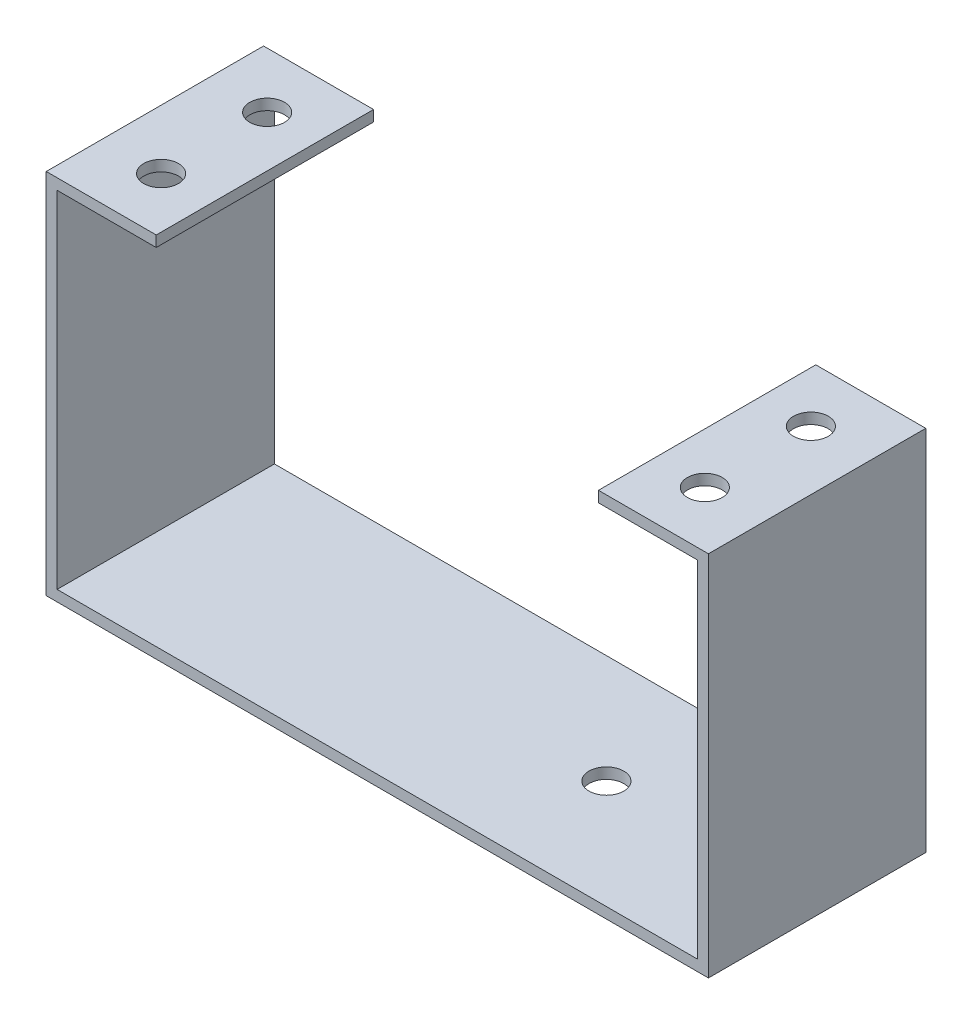
ISO-10303-21;
HEADER;
FILE_DESCRIPTION(('STEP AP214'),'2;1');
FILE_NAME('part.step','',(''),(''),'','','');
FILE_SCHEMA(('AUTOMOTIVE_DESIGN { 1 0 10303 214 1 1 1 1 }'));
ENDSEC;
DATA;
#1=APPLICATION_CONTEXT('core data for automotive mechanical design processes');
#2=APPLICATION_PROTOCOL_DEFINITION('international standard','automotive_design',2000,#1);
#3=PRODUCT_CONTEXT('',#1,'mechanical');
#4=PRODUCT('Part','Part','',(#3));
#5=PRODUCT_RELATED_PRODUCT_CATEGORY('part','',(#4));
#6=PRODUCT_DEFINITION_FORMATION('','',#4);
#7=PRODUCT_DEFINITION_CONTEXT('part definition',#1,'design');
#8=PRODUCT_DEFINITION('design','',#6,#7);
#9=PRODUCT_DEFINITION_SHAPE('','',#8);
#10=(LENGTH_UNIT() NAMED_UNIT(*) SI_UNIT(.MILLI.,.METRE.));
#11=(NAMED_UNIT(*) PLANE_ANGLE_UNIT() SI_UNIT($,.RADIAN.));
#12=(NAMED_UNIT(*) SI_UNIT($,.STERADIAN.) SOLID_ANGLE_UNIT());
#13=UNCERTAINTY_MEASURE_WITH_UNIT(LENGTH_MEASURE(1.E-05),#10,'distance_accuracy_value','');
#14=(GEOMETRIC_REPRESENTATION_CONTEXT(3) GLOBAL_UNCERTAINTY_ASSIGNED_CONTEXT((#13)) GLOBAL_UNIT_ASSIGNED_CONTEXT((#10,
#11,#12)) REPRESENTATION_CONTEXT('',''));
#15=CARTESIAN_POINT('',(0.,0.,0.));
#16=DIRECTION('',(0.,0.,1.));
#17=DIRECTION('',(1.,0.,0.));
#18=AXIS2_PLACEMENT_3D('',#15,#16,#17);
#19=CARTESIAN_POINT('',(0.999999999999998,33.81,-20.));
#20=DIRECTION('',(-1.,0.,0.));
#21=DIRECTION('',(0.,0.,1.));
#22=AXIS2_PLACEMENT_3D('',#19,#20,#21);
#23=PLANE('',#22);
#24=DIRECTION('',(0.,0.,-1.));
#25=VECTOR('',#24,1.);
#26=CARTESIAN_POINT('',(1.,32.81,0.));
#27=LINE('',#26,#25);
#28=CARTESIAN_POINT('',(1.,32.81,0.));
#29=VERTEX_POINT('',#28);
#30=CARTESIAN_POINT('',(0.999999999999998,32.81,-20.));
#31=VERTEX_POINT('',#30);
#32=EDGE_CURVE('E148',#29,#31,#27,.T.);
#33=ORIENTED_EDGE('',*,*,#32,.F.);
#34=DIRECTION('',(0.,-1.,0.));
#35=VECTOR('',#34,1.);
#36=CARTESIAN_POINT('',(1.,33.81,0.));
#37=LINE('',#36,#35);
#38=CARTESIAN_POINT('',(1.,1.,0.));
#39=VERTEX_POINT('',#38);
#40=EDGE_CURVE('E52',#29,#39,#37,.T.);
#41=ORIENTED_EDGE('',*,*,#40,.T.);
#42=DIRECTION('',(0.,0.,-1.));
#43=VECTOR('',#42,1.);
#44=CARTESIAN_POINT('',(0.999999999999998,1.,-20.));
#45=LINE('',#44,#43);
#46=CARTESIAN_POINT('',(1.,1.,-20.));
#47=VERTEX_POINT('',#46);
#48=EDGE_CURVE('E174',#39,#47,#45,.T.);
#49=ORIENTED_EDGE('',*,*,#48,.T.);
#50=DIRECTION('',(0.,-1.,0.));
#51=VECTOR('',#50,1.);
#52=CARTESIAN_POINT('',(0.999999999999998,33.81,-20.));
#53=LINE('',#52,#51);
#54=EDGE_CURVE('E60',#31,#47,#53,.T.);
#55=ORIENTED_EDGE('',*,*,#54,.F.);
#56=EDGE_LOOP('',(#33,#41,#49,#55));
#57=FACE_BOUND('',#56,.T.);
#58=ADVANCED_FACE('F34',(#57),#23,.F.);
#59=CARTESIAN_POINT('',(59.94,33.81,-20.));
#60=DIRECTION('',(1.,0.,0.));
#61=DIRECTION('',(0.,0.,-1.));
#62=AXIS2_PLACEMENT_3D('',#59,#60,#61);
#63=PLANE('',#62);
#64=DIRECTION('',(0.,0.,1.));
#65=VECTOR('',#64,1.);
#66=CARTESIAN_POINT('',(59.94,32.81,-20.));
#67=LINE('',#66,#65);
#68=CARTESIAN_POINT('',(59.94,32.81,-20.));
#69=VERTEX_POINT('',#68);
#70=CARTESIAN_POINT('',(59.94,32.81,0.));
#71=VERTEX_POINT('',#70);
#72=EDGE_CURVE('E152',#69,#71,#67,.T.);
#73=ORIENTED_EDGE('',*,*,#72,.F.);
#74=DIRECTION('',(0.,-1.,0.));
#75=VECTOR('',#74,1.);
#76=CARTESIAN_POINT('',(59.94,33.81,-20.));
#77=LINE('',#76,#75);
#78=CARTESIAN_POINT('',(59.94,1.,-20.));
#79=VERTEX_POINT('',#78);
#80=EDGE_CURVE('E38',#69,#79,#77,.T.);
#81=ORIENTED_EDGE('',*,*,#80,.T.);
#82=DIRECTION('',(0.,0.,1.));
#83=VECTOR('',#82,1.);
#84=CARTESIAN_POINT('',(59.94,1.,-20.));
#85=LINE('',#84,#83);
#86=CARTESIAN_POINT('',(59.94,1.,0.));
#87=VERTEX_POINT('',#86);
#88=EDGE_CURVE('E186',#79,#87,#85,.T.);
#89=ORIENTED_EDGE('',*,*,#88,.T.);
#90=DIRECTION('',(0.,-1.,0.));
#91=VECTOR('',#90,1.);
#92=CARTESIAN_POINT('',(59.94,33.81,0.));
#93=LINE('',#92,#91);
#94=EDGE_CURVE('E195',#71,#87,#93,.T.);
#95=ORIENTED_EDGE('',*,*,#94,.F.);
#96=EDGE_LOOP('',(#73,#81,#89,#95));
#97=FACE_BOUND('',#96,.T.);
#98=ADVANCED_FACE('F242',(#97),#63,.F.);
#99=CARTESIAN_POINT('',(0.,1.,0.));
#100=DIRECTION('',(0.,-1.,0.));
#101=DIRECTION('',(0.,0.,-1.));
#102=AXIS2_PLACEMENT_3D('',#99,#100,#101);
#103=PLANE('',#102);
#104=CARTESIAN_POINT('',(41.55,1.,-10.));
#105=DIRECTION('',(0.,-1.,0.));
#106=DIRECTION('',(0.,0.,-1.));
#107=AXIS2_PLACEMENT_3D('',#104,#105,#106);
#108=CIRCLE('',#107,1.6);
#109=CARTESIAN_POINT('',(41.55,1.,-11.6));
#110=VERTEX_POINT('',#109);
#111=EDGE_CURVE('E279',#110,#110,#108,.T.);
#112=ORIENTED_EDGE('',*,*,#111,.T.);
#113=EDGE_LOOP('',(#112));
#114=FACE_BOUND('',#113,.T.);
#115=ORIENTED_EDGE('',*,*,#48,.F.);
#116=DIRECTION('',(1.,0.,0.));
#117=VECTOR('',#116,1.);
#118=CARTESIAN_POINT('',(0.,1.,0.));
#119=LINE('',#118,#117);
#120=EDGE_CURVE('E208',#39,#87,#119,.T.);
#121=ORIENTED_EDGE('',*,*,#120,.T.);
#122=ORIENTED_EDGE('',*,*,#88,.F.);
#123=DIRECTION('',(-1.,0.,0.));
#124=VECTOR('',#123,1.);
#125=CARTESIAN_POINT('',(0.,1.,-20.));
#126=LINE('',#125,#124);
#127=EDGE_CURVE('E204',#79,#47,#126,.T.);
#128=ORIENTED_EDGE('',*,*,#127,.T.);
#129=EDGE_LOOP('',(#115,#121,#122,#128));
#130=FACE_BOUND('',#129,.T.);
#131=ADVANCED_FACE('F245',(#114,#130),#103,.F.);
#132=CARTESIAN_POINT('',(0.,1.,0.));
#133=DIRECTION('',(1.,0.,0.));
#134=DIRECTION('',(0.,0.,-1.));
#135=AXIS2_PLACEMENT_3D('',#132,#133,#134);
#136=PLANE('',#135);
#137=DIRECTION('',(0.,0.,1.));
#138=VECTOR('',#137,1.);
#139=CARTESIAN_POINT('',(0.,0.,0.));
#140=LINE('',#139,#138);
#141=CARTESIAN_POINT('',(0.,0.,-20.));
#142=VERTEX_POINT('',#141);
#143=CARTESIAN_POINT('',(0.,0.,0.));
#144=VERTEX_POINT('',#143);
#145=EDGE_CURVE('E235',#142,#144,#140,.T.);
#146=ORIENTED_EDGE('',*,*,#145,.T.);
#147=DIRECTION('',(0.,-1.,0.));
#148=VECTOR('',#147,1.);
#149=CARTESIAN_POINT('',(0.,1.,0.));
#150=LINE('',#149,#148);
#151=CARTESIAN_POINT('',(0.,33.81,0.));
#152=VERTEX_POINT('',#151);
#153=EDGE_CURVE('E11',#152,#144,#150,.T.);
#154=ORIENTED_EDGE('',*,*,#153,.F.);
#155=DIRECTION('',(0.,0.,1.));
#156=VECTOR('',#155,1.);
#157=CARTESIAN_POINT('',(0.,33.81,-20.));
#158=LINE('',#157,#156);
#159=CARTESIAN_POINT('',(0.,33.81,-20.));
#160=VERTEX_POINT('',#159);
#161=EDGE_CURVE('E175',#160,#152,#158,.T.);
#162=ORIENTED_EDGE('',*,*,#161,.F.);
#163=DIRECTION('',(0.,-1.,0.));
#164=VECTOR('',#163,1.);
#165=CARTESIAN_POINT('',(0.,1.,-20.));
#166=LINE('',#165,#164);
#167=EDGE_CURVE('E213',#160,#142,#166,.T.);
#168=ORIENTED_EDGE('',*,*,#167,.T.);
#169=EDGE_LOOP('',(#146,#154,#162,#168));
#170=FACE_BOUND('',#169,.T.);
#171=ADVANCED_FACE('F36',(#170),#136,.F.);
#172=CARTESIAN_POINT('',(0.,1.,0.));
#173=DIRECTION('',(0.,0.,-1.));
#174=DIRECTION('',(-1.,0.,0.));
#175=AXIS2_PLACEMENT_3D('',#172,#173,#174);
#176=PLANE('',#175);
#177=DIRECTION('',(1.,0.,0.));
#178=VECTOR('',#177,1.);
#179=CARTESIAN_POINT('',(0.,0.,0.));
#180=LINE('',#179,#178);
#181=CARTESIAN_POINT('',(60.94,0.,0.));
#182=VERTEX_POINT('',#181);
#183=EDGE_CURVE('E219',#144,#182,#180,.T.);
#184=ORIENTED_EDGE('',*,*,#183,.T.);
#185=DIRECTION('',(0.,-1.,0.));
#186=VECTOR('',#185,1.);
#187=CARTESIAN_POINT('',(60.94,1.,0.));
#188=LINE('',#187,#186);
#189=CARTESIAN_POINT('',(60.94,33.81,0.));
#190=VERTEX_POINT('',#189);
#191=EDGE_CURVE('E44',#190,#182,#188,.T.);
#192=ORIENTED_EDGE('',*,*,#191,.F.);
#193=DIRECTION('',(1.,0.,0.));
#194=VECTOR('',#193,1.);
#195=CARTESIAN_POINT('',(60.94,33.81,0.));
#196=LINE('',#195,#194);
#197=CARTESIAN_POINT('',(50.82,33.81,0.));
#198=VERTEX_POINT('',#197);
#199=EDGE_CURVE('E192',#198,#190,#196,.T.);
#200=ORIENTED_EDGE('',*,*,#199,.F.);
#201=DIRECTION('',(0.,1.,0.));
#202=VECTOR('',#201,1.);
#203=CARTESIAN_POINT('',(50.82,33.81,0.));
#204=LINE('',#203,#202);
#205=CARTESIAN_POINT('',(50.82,32.81,0.));
#206=VERTEX_POINT('',#205);
#207=EDGE_CURVE('E163',#206,#198,#204,.T.);
#208=ORIENTED_EDGE('',*,*,#207,.F.);
#209=DIRECTION('',(1.,0.,0.));
#210=VECTOR('',#209,1.);
#211=CARTESIAN_POINT('',(50.82,32.81,0.));
#212=LINE('',#211,#210);
#213=EDGE_CURVE('E168',#206,#71,#212,.T.);
#214=ORIENTED_EDGE('',*,*,#213,.T.);
#215=ORIENTED_EDGE('',*,*,#94,.T.);
#216=ORIENTED_EDGE('',*,*,#120,.F.);
#217=ORIENTED_EDGE('',*,*,#40,.F.);
#218=DIRECTION('',(-1.,0.,0.));
#219=VECTOR('',#218,1.);
#220=CARTESIAN_POINT('',(10.12,32.81,0.));
#221=LINE('',#220,#219);
#222=CARTESIAN_POINT('',(10.12,32.81,0.));
#223=VERTEX_POINT('',#222);
#224=EDGE_CURVE('E133',#223,#29,#221,.T.);
#225=ORIENTED_EDGE('',*,*,#224,.F.);
#226=DIRECTION('',(0.,-1.,0.));
#227=VECTOR('',#226,1.);
#228=CARTESIAN_POINT('',(10.12,33.81,0.));
#229=LINE('',#228,#227);
#230=CARTESIAN_POINT('',(10.12,33.81,0.));
#231=VERTEX_POINT('',#230);
#232=EDGE_CURVE('E139',#231,#223,#229,.T.);
#233=ORIENTED_EDGE('',*,*,#232,.F.);
#234=DIRECTION('',(1.,0.,0.));
#235=VECTOR('',#234,1.);
#236=CARTESIAN_POINT('',(0.,33.81,0.));
#237=LINE('',#236,#235);
#238=EDGE_CURVE('E178',#152,#231,#237,.T.);
#239=ORIENTED_EDGE('',*,*,#238,.F.);
#240=ORIENTED_EDGE('',*,*,#153,.T.);
#241=EDGE_LOOP('',(#184,#192,#200,#208,#214,#215,#216,#217,#225,#233,#239,#240));
#242=FACE_BOUND('',#241,.T.);
#243=ADVANCED_FACE('F150',(#242),#176,.F.);
#244=CARTESIAN_POINT('',(60.94,1.,0.));
#245=DIRECTION('',(-1.,0.,0.));
#246=DIRECTION('',(0.,0.,1.));
#247=AXIS2_PLACEMENT_3D('',#244,#245,#246);
#248=PLANE('',#247);
#249=DIRECTION('',(0.,0.,-1.));
#250=VECTOR('',#249,1.);
#251=CARTESIAN_POINT('',(60.94,0.,0.));
#252=LINE('',#251,#250);
#253=CARTESIAN_POINT('',(60.94,0.,-20.));
#254=VERTEX_POINT('',#253);
#255=EDGE_CURVE('E214',#182,#254,#252,.T.);
#256=ORIENTED_EDGE('',*,*,#255,.T.);
#257=DIRECTION('',(0.,-1.,0.));
#258=VECTOR('',#257,1.);
#259=CARTESIAN_POINT('',(60.94,1.,-20.));
#260=LINE('',#259,#258);
#261=CARTESIAN_POINT('',(60.94,33.81,-20.));
#262=VERTEX_POINT('',#261);
#263=EDGE_CURVE('E224',#262,#254,#260,.T.);
#264=ORIENTED_EDGE('',*,*,#263,.F.);
#265=DIRECTION('',(0.,0.,-1.));
#266=VECTOR('',#265,1.);
#267=CARTESIAN_POINT('',(60.94,33.81,-20.));
#268=LINE('',#267,#266);
#269=EDGE_CURVE('E187',#190,#262,#268,.T.);
#270=ORIENTED_EDGE('',*,*,#269,.F.);
#271=ORIENTED_EDGE('',*,*,#191,.T.);
#272=EDGE_LOOP('',(#256,#264,#270,#271));
#273=FACE_BOUND('',#272,.T.);
#274=ADVANCED_FACE('F230',(#273),#248,.F.);
#275=CARTESIAN_POINT('',(0.,1.,-20.));
#276=DIRECTION('',(0.,0.,1.));
#277=DIRECTION('',(1.,0.,0.));
#278=AXIS2_PLACEMENT_3D('',#275,#276,#277);
#279=PLANE('',#278);
#280=DIRECTION('',(-1.,0.,0.));
#281=VECTOR('',#280,1.);
#282=CARTESIAN_POINT('',(0.,0.,-20.));
#283=LINE('',#282,#281);
#284=EDGE_CURVE('E210',#254,#142,#283,.T.);
#285=ORIENTED_EDGE('',*,*,#284,.T.);
#286=ORIENTED_EDGE('',*,*,#167,.F.);
#287=DIRECTION('',(-1.,0.,0.));
#288=VECTOR('',#287,1.);
#289=CARTESIAN_POINT('',(0.,33.81,-20.));
#290=LINE('',#289,#288);
#291=CARTESIAN_POINT('',(10.12,33.81,-20.));
#292=VERTEX_POINT('',#291);
#293=EDGE_CURVE('E180',#292,#160,#290,.T.);
#294=ORIENTED_EDGE('',*,*,#293,.F.);
#295=DIRECTION('',(0.,1.,0.));
#296=VECTOR('',#295,1.);
#297=CARTESIAN_POINT('',(10.12,33.81,-20.));
#298=LINE('',#297,#296);
#299=CARTESIAN_POINT('',(10.12,32.81,-20.));
#300=VERTEX_POINT('',#299);
#301=EDGE_CURVE('E138',#300,#292,#298,.T.);
#302=ORIENTED_EDGE('',*,*,#301,.F.);
#303=DIRECTION('',(-1.,0.,0.));
#304=VECTOR('',#303,1.);
#305=CARTESIAN_POINT('',(10.12,32.81,-20.));
#306=LINE('',#305,#304);
#307=EDGE_CURVE('E134',#300,#31,#306,.T.);
#308=ORIENTED_EDGE('',*,*,#307,.T.);
#309=ORIENTED_EDGE('',*,*,#54,.T.);
#310=ORIENTED_EDGE('',*,*,#127,.F.);
#311=ORIENTED_EDGE('',*,*,#80,.F.);
#312=DIRECTION('',(1.,0.,0.));
#313=VECTOR('',#312,1.);
#314=CARTESIAN_POINT('',(50.82,32.81,-20.));
#315=LINE('',#314,#313);
#316=CARTESIAN_POINT('',(50.82,32.81,-20.));
#317=VERTEX_POINT('',#316);
#318=EDGE_CURVE('E172',#317,#69,#315,.T.);
#319=ORIENTED_EDGE('',*,*,#318,.F.);
#320=DIRECTION('',(0.,-1.,0.));
#321=VECTOR('',#320,1.);
#322=CARTESIAN_POINT('',(50.82,33.81,-20.));
#323=LINE('',#322,#321);
#324=CARTESIAN_POINT('',(50.82,33.81,-20.));
#325=VERTEX_POINT('',#324);
#326=EDGE_CURVE('E154',#325,#317,#323,.T.);
#327=ORIENTED_EDGE('',*,*,#326,.F.);
#328=DIRECTION('',(-1.,0.,0.));
#329=VECTOR('',#328,1.);
#330=CARTESIAN_POINT('',(60.94,33.81,-20.));
#331=LINE('',#330,#329);
#332=EDGE_CURVE('E190',#262,#325,#331,.T.);
#333=ORIENTED_EDGE('',*,*,#332,.F.);
#334=ORIENTED_EDGE('',*,*,#263,.T.);
#335=EDGE_LOOP('',(#285,#286,#294,#302,#308,#309,#310,#311,#319,#327,#333,#334));
#336=FACE_BOUND('',#335,.T.);
#337=ADVANCED_FACE('F246',(#336),#279,.F.);
#338=CARTESIAN_POINT('',(0.,0.,0.));
#339=DIRECTION('',(0.,-1.,0.));
#340=DIRECTION('',(0.,0.,-1.));
#341=AXIS2_PLACEMENT_3D('',#338,#339,#340);
#342=PLANE('',#341);
#343=CARTESIAN_POINT('',(41.55,0.,-10.));
#344=DIRECTION('',(0.,-1.,0.));
#345=DIRECTION('',(0.,0.,-1.));
#346=AXIS2_PLACEMENT_3D('',#343,#344,#345);
#347=CIRCLE('',#346,1.6);
#348=CARTESIAN_POINT('',(41.55,0.,-11.6));
#349=VERTEX_POINT('',#348);
#350=EDGE_CURVE('E282',#349,#349,#347,.T.);
#351=ORIENTED_EDGE('',*,*,#350,.F.);
#352=EDGE_LOOP('',(#351));
#353=FACE_BOUND('',#352,.T.);
#354=ORIENTED_EDGE('',*,*,#145,.F.);
#355=ORIENTED_EDGE('',*,*,#284,.F.);
#356=ORIENTED_EDGE('',*,*,#255,.F.);
#357=ORIENTED_EDGE('',*,*,#183,.F.);
#358=EDGE_LOOP('',(#354,#355,#356,#357));
#359=FACE_BOUND('',#358,.T.);
#360=ADVANCED_FACE('F233',(#353,#359),#342,.T.);
#361=CARTESIAN_POINT('',(0.,33.81,0.));
#362=DIRECTION('',(0.,-1.,0.));
#363=DIRECTION('',(0.,0.,-1.));
#364=AXIS2_PLACEMENT_3D('',#361,#362,#363);
#365=PLANE('',#364);
#366=CARTESIAN_POINT('',(55.49,33.81,-14.88));
#367=DIRECTION('',(0.,1.,0.));
#368=DIRECTION('',(0.,0.,1.));
#369=AXIS2_PLACEMENT_3D('',#366,#367,#368);
#370=CIRCLE('',#369,1.6);
#371=CARTESIAN_POINT('',(55.49,33.81,-13.28));
#372=VERTEX_POINT('',#371);
#373=EDGE_CURVE('E296',#372,#372,#370,.T.);
#374=ORIENTED_EDGE('',*,*,#373,.F.);
#375=EDGE_LOOP('',(#374));
#376=FACE_BOUND('',#375,.T.);
#377=CARTESIAN_POINT('',(55.49,33.81,-5.12));
#378=DIRECTION('',(0.,1.,0.));
#379=DIRECTION('',(0.,0.,1.));
#380=AXIS2_PLACEMENT_3D('',#377,#378,#379);
#381=CIRCLE('',#380,1.6);
#382=CARTESIAN_POINT('',(55.49,33.81,-3.52));
#383=VERTEX_POINT('',#382);
#384=EDGE_CURVE('E302',#383,#383,#381,.T.);
#385=ORIENTED_EDGE('',*,*,#384,.F.);
#386=EDGE_LOOP('',(#385));
#387=FACE_BOUND('',#386,.T.);
#388=ORIENTED_EDGE('',*,*,#269,.T.);
#389=ORIENTED_EDGE('',*,*,#332,.T.);
#390=DIRECTION('',(0.,0.,-1.));
#391=VECTOR('',#390,1.);
#392=CARTESIAN_POINT('',(50.82,33.81,-20.));
#393=LINE('',#392,#391);
#394=EDGE_CURVE('E166',#198,#325,#393,.T.);
#395=ORIENTED_EDGE('',*,*,#394,.F.);
#396=ORIENTED_EDGE('',*,*,#199,.T.);
#397=EDGE_LOOP('',(#388,#389,#395,#396));
#398=FACE_BOUND('',#397,.T.);
#399=ADVANCED_FACE('F254',(#376,#387,#398),#365,.F.);
#400=CARTESIAN_POINT('',(0.,33.81,0.));
#401=DIRECTION('',(0.,1.,0.));
#402=DIRECTION('',(0.,0.,1.));
#403=AXIS2_PLACEMENT_3D('',#400,#401,#402);
#404=PLANE('',#403);
#405=CARTESIAN_POINT('',(5.45,33.81,-14.88));
#406=DIRECTION('',(0.,1.,0.));
#407=DIRECTION('',(0.,0.,1.));
#408=AXIS2_PLACEMENT_3D('',#405,#406,#407);
#409=CIRCLE('',#408,1.6);
#410=CARTESIAN_POINT('',(5.45,33.81,-13.28));
#411=VERTEX_POINT('',#410);
#412=EDGE_CURVE('E281',#411,#411,#409,.T.);
#413=ORIENTED_EDGE('',*,*,#412,.F.);
#414=EDGE_LOOP('',(#413));
#415=FACE_BOUND('',#414,.T.);
#416=CARTESIAN_POINT('',(5.45,33.81,-5.12));
#417=DIRECTION('',(0.,1.,0.));
#418=DIRECTION('',(0.,0.,1.));
#419=AXIS2_PLACEMENT_3D('',#416,#417,#418);
#420=CIRCLE('',#419,1.6);
#421=CARTESIAN_POINT('',(5.45,33.81,-3.52));
#422=VERTEX_POINT('',#421);
#423=EDGE_CURVE('E291',#422,#422,#420,.T.);
#424=ORIENTED_EDGE('',*,*,#423,.F.);
#425=EDGE_LOOP('',(#424));
#426=FACE_BOUND('',#425,.T.);
#427=ORIENTED_EDGE('',*,*,#161,.T.);
#428=ORIENTED_EDGE('',*,*,#238,.T.);
#429=DIRECTION('',(0.,0.,1.));
#430=VECTOR('',#429,1.);
#431=CARTESIAN_POINT('',(10.12,33.81,0.));
#432=LINE('',#431,#430);
#433=EDGE_CURVE('E145',#292,#231,#432,.T.);
#434=ORIENTED_EDGE('',*,*,#433,.F.);
#435=ORIENTED_EDGE('',*,*,#293,.T.);
#436=EDGE_LOOP('',(#427,#428,#434,#435));
#437=FACE_BOUND('',#436,.T.);
#438=ADVANCED_FACE('F266',(#415,#426,#437),#404,.T.);
#439=CARTESIAN_POINT('',(50.82,32.81,-20.));
#440=DIRECTION('',(0.,1.,0.));
#441=DIRECTION('',(0.,0.,1.));
#442=AXIS2_PLACEMENT_3D('',#439,#440,#441);
#443=PLANE('',#442);
#444=CARTESIAN_POINT('',(55.49,32.81,-14.88));
#445=DIRECTION('',(0.,1.,0.));
#446=DIRECTION('',(0.,0.,1.));
#447=AXIS2_PLACEMENT_3D('',#444,#445,#446);
#448=CIRCLE('',#447,1.6);
#449=CARTESIAN_POINT('',(55.49,32.81,-13.28));
#450=VERTEX_POINT('',#449);
#451=EDGE_CURVE('E299',#450,#450,#448,.T.);
#452=ORIENTED_EDGE('',*,*,#451,.T.);
#453=EDGE_LOOP('',(#452));
#454=FACE_BOUND('',#453,.T.);
#455=CARTESIAN_POINT('',(55.49,32.81,-5.12));
#456=DIRECTION('',(0.,1.,0.));
#457=DIRECTION('',(0.,0.,1.));
#458=AXIS2_PLACEMENT_3D('',#455,#456,#457);
#459=CIRCLE('',#458,1.6);
#460=CARTESIAN_POINT('',(55.49,32.81,-3.52));
#461=VERTEX_POINT('',#460);
#462=EDGE_CURVE('E305',#461,#461,#459,.T.);
#463=ORIENTED_EDGE('',*,*,#462,.T.);
#464=EDGE_LOOP('',(#463));
#465=FACE_BOUND('',#464,.T.);
#466=ORIENTED_EDGE('',*,*,#72,.T.);
#467=ORIENTED_EDGE('',*,*,#213,.F.);
#468=DIRECTION('',(0.,0.,1.));
#469=VECTOR('',#468,1.);
#470=CARTESIAN_POINT('',(50.82,32.81,-20.));
#471=LINE('',#470,#469);
#472=EDGE_CURVE('E161',#317,#206,#471,.T.);
#473=ORIENTED_EDGE('',*,*,#472,.F.);
#474=ORIENTED_EDGE('',*,*,#318,.T.);
#475=EDGE_LOOP('',(#466,#467,#473,#474));
#476=FACE_BOUND('',#475,.T.);
#477=ADVANCED_FACE('F314',(#454,#465,#476),#443,.F.);
#478=CARTESIAN_POINT('',(50.82,0.,0.));
#479=DIRECTION('',(-1.,0.,0.));
#480=DIRECTION('',(0.,0.,1.));
#481=AXIS2_PLACEMENT_3D('',#478,#479,#480);
#482=PLANE('',#481);
#483=ORIENTED_EDGE('',*,*,#326,.T.);
#484=ORIENTED_EDGE('',*,*,#472,.T.);
#485=ORIENTED_EDGE('',*,*,#207,.T.);
#486=ORIENTED_EDGE('',*,*,#394,.T.);
#487=EDGE_LOOP('',(#483,#484,#485,#486));
#488=FACE_BOUND('',#487,.T.);
#489=ADVANCED_FACE('F318',(#488),#482,.T.);
#490=CARTESIAN_POINT('',(10.12,32.81,0.));
#491=DIRECTION('',(0.,1.,0.));
#492=DIRECTION('',(0.,0.,1.));
#493=AXIS2_PLACEMENT_3D('',#490,#491,#492);
#494=PLANE('',#493);
#495=CARTESIAN_POINT('',(5.45,32.81,-14.88));
#496=DIRECTION('',(0.,1.,0.));
#497=DIRECTION('',(0.,0.,1.));
#498=AXIS2_PLACEMENT_3D('',#495,#496,#497);
#499=CIRCLE('',#498,1.6);
#500=CARTESIAN_POINT('',(5.45,32.81,-13.28));
#501=VERTEX_POINT('',#500);
#502=EDGE_CURVE('E285',#501,#501,#499,.T.);
#503=ORIENTED_EDGE('',*,*,#502,.T.);
#504=EDGE_LOOP('',(#503));
#505=FACE_BOUND('',#504,.T.);
#506=CARTESIAN_POINT('',(5.45,32.81,-5.12));
#507=DIRECTION('',(0.,1.,0.));
#508=DIRECTION('',(0.,0.,1.));
#509=AXIS2_PLACEMENT_3D('',#506,#507,#508);
#510=CIRCLE('',#509,1.6);
#511=CARTESIAN_POINT('',(5.45,32.81,-3.52));
#512=VERTEX_POINT('',#511);
#513=EDGE_CURVE('E293',#512,#512,#510,.T.);
#514=ORIENTED_EDGE('',*,*,#513,.T.);
#515=EDGE_LOOP('',(#514));
#516=FACE_BOUND('',#515,.T.);
#517=ORIENTED_EDGE('',*,*,#32,.T.);
#518=ORIENTED_EDGE('',*,*,#307,.F.);
#519=DIRECTION('',(0.,0.,-1.));
#520=VECTOR('',#519,1.);
#521=CARTESIAN_POINT('',(10.12,32.81,0.));
#522=LINE('',#521,#520);
#523=EDGE_CURVE('E129',#223,#300,#522,.T.);
#524=ORIENTED_EDGE('',*,*,#523,.F.);
#525=ORIENTED_EDGE('',*,*,#224,.T.);
#526=EDGE_LOOP('',(#517,#518,#524,#525));
#527=FACE_BOUND('',#526,.T.);
#528=ADVANCED_FACE('F131',(#505,#516,#527),#494,.F.);
#529=CARTESIAN_POINT('',(10.12,0.,0.));
#530=DIRECTION('',(1.,0.,0.));
#531=DIRECTION('',(0.,0.,-1.));
#532=AXIS2_PLACEMENT_3D('',#529,#530,#531);
#533=PLANE('',#532);
#534=ORIENTED_EDGE('',*,*,#232,.T.);
#535=ORIENTED_EDGE('',*,*,#523,.T.);
#536=ORIENTED_EDGE('',*,*,#301,.T.);
#537=ORIENTED_EDGE('',*,*,#433,.T.);
#538=EDGE_LOOP('',(#534,#535,#536,#537));
#539=FACE_BOUND('',#538,.T.);
#540=ADVANCED_FACE('F143',(#539),#533,.T.);
#541=CARTESIAN_POINT('',(55.49,32.81,-5.12));
#542=DIRECTION('',(0.,1.,0.));
#543=DIRECTION('',(0.,0.,1.));
#544=AXIS2_PLACEMENT_3D('',#541,#542,#543);
#545=CYLINDRICAL_SURFACE('',#544,1.6);
#546=ORIENTED_EDGE('',*,*,#462,.F.);
#547=EDGE_LOOP('',(#546));
#548=FACE_BOUND('',#547,.T.);
#549=ORIENTED_EDGE('',*,*,#384,.T.);
#550=EDGE_LOOP('',(#549));
#551=FACE_BOUND('',#550,.T.);
#552=ADVANCED_FACE('F335',(#548,#551),#545,.F.);
#553=CARTESIAN_POINT('',(55.49,32.81,-14.88));
#554=DIRECTION('',(0.,1.,0.));
#555=DIRECTION('',(0.,0.,1.));
#556=AXIS2_PLACEMENT_3D('',#553,#554,#555);
#557=CYLINDRICAL_SURFACE('',#556,1.6);
#558=ORIENTED_EDGE('',*,*,#451,.F.);
#559=EDGE_LOOP('',(#558));
#560=FACE_BOUND('',#559,.T.);
#561=ORIENTED_EDGE('',*,*,#373,.T.);
#562=EDGE_LOOP('',(#561));
#563=FACE_BOUND('',#562,.T.);
#564=ADVANCED_FACE('F338',(#560,#563),#557,.F.);
#565=CARTESIAN_POINT('',(5.45,32.81,-5.12));
#566=DIRECTION('',(0.,1.,0.));
#567=DIRECTION('',(0.,0.,1.));
#568=AXIS2_PLACEMENT_3D('',#565,#566,#567);
#569=CYLINDRICAL_SURFACE('',#568,1.6);
#570=ORIENTED_EDGE('',*,*,#513,.F.);
#571=EDGE_LOOP('',(#570));
#572=FACE_BOUND('',#571,.T.);
#573=ORIENTED_EDGE('',*,*,#423,.T.);
#574=EDGE_LOOP('',(#573));
#575=FACE_BOUND('',#574,.T.);
#576=ADVANCED_FACE('F342',(#572,#575),#569,.F.);
#577=CARTESIAN_POINT('',(5.45,32.81,-14.88));
#578=DIRECTION('',(0.,1.,0.));
#579=DIRECTION('',(0.,0.,1.));
#580=AXIS2_PLACEMENT_3D('',#577,#578,#579);
#581=CYLINDRICAL_SURFACE('',#580,1.6);
#582=ORIENTED_EDGE('',*,*,#502,.F.);
#583=EDGE_LOOP('',(#582));
#584=FACE_BOUND('',#583,.T.);
#585=ORIENTED_EDGE('',*,*,#412,.T.);
#586=EDGE_LOOP('',(#585));
#587=FACE_BOUND('',#586,.T.);
#588=ADVANCED_FACE('F346',(#584,#587),#581,.F.);
#589=CARTESIAN_POINT('',(41.55,1.,-10.));
#590=DIRECTION('',(0.,-1.,0.));
#591=DIRECTION('',(0.,0.,-1.));
#592=AXIS2_PLACEMENT_3D('',#589,#590,#591);
#593=CYLINDRICAL_SURFACE('',#592,1.6);
#594=ORIENTED_EDGE('',*,*,#111,.F.);
#595=EDGE_LOOP('',(#594));
#596=FACE_BOUND('',#595,.T.);
#597=ORIENTED_EDGE('',*,*,#350,.T.);
#598=EDGE_LOOP('',(#597));
#599=FACE_BOUND('',#598,.T.);
#600=ADVANCED_FACE('F350',(#596,#599),#593,.F.);
#601=CLOSED_SHELL('',(#58,#98,#131,#171,#243,#274,#337,#360,#399,#438,#477,#489,#528,#540,#552,
#564,#576,#588,#600));
#602=MANIFOLD_SOLID_BREP('B2',#601);
#603=ADVANCED_BREP_SHAPE_REPRESENTATION('',(#18,#602),#14);
#604=SHAPE_DEFINITION_REPRESENTATION(#9,#603);
ENDSEC;
END-ISO-10303-21;
